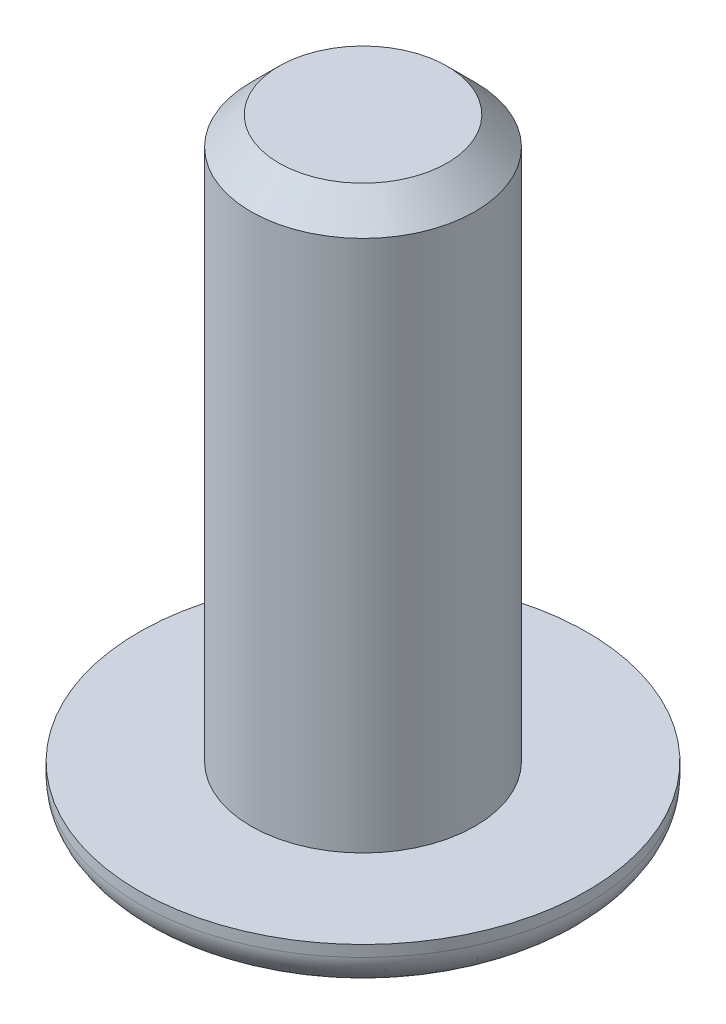
ISO-10303-21;
HEADER;
FILE_DESCRIPTION(('STEP AP214'),'2;1');
FILE_NAME('part.step','',(''),(''),'','','');
FILE_SCHEMA(('AUTOMOTIVE_DESIGN { 1 0 10303 214 1 1 1 1 }'));
ENDSEC;
DATA;
#1=APPLICATION_CONTEXT('core data for automotive mechanical design processes');
#2=APPLICATION_PROTOCOL_DEFINITION('international standard','automotive_design',2000,#1);
#3=PRODUCT_CONTEXT('',#1,'mechanical');
#4=PRODUCT('Part','Part','',(#3));
#5=PRODUCT_RELATED_PRODUCT_CATEGORY('part','',(#4));
#6=PRODUCT_DEFINITION_FORMATION('','',#4);
#7=PRODUCT_DEFINITION_CONTEXT('part definition',#1,'design');
#8=PRODUCT_DEFINITION('design','',#6,#7);
#9=PRODUCT_DEFINITION_SHAPE('','',#8);
#10=(LENGTH_UNIT() NAMED_UNIT(*) SI_UNIT(.MILLI.,.METRE.));
#11=(NAMED_UNIT(*) PLANE_ANGLE_UNIT() SI_UNIT($,.RADIAN.));
#12=(NAMED_UNIT(*) SI_UNIT($,.STERADIAN.) SOLID_ANGLE_UNIT());
#13=UNCERTAINTY_MEASURE_WITH_UNIT(LENGTH_MEASURE(1.E-05),#10,'distance_accuracy_value','');
#14=(GEOMETRIC_REPRESENTATION_CONTEXT(3) GLOBAL_UNCERTAINTY_ASSIGNED_CONTEXT((#13)) GLOBAL_UNIT_ASSIGNED_CONTEXT((#10,
#11,#12)) REPRESENTATION_CONTEXT('',''));
#15=CARTESIAN_POINT('',(0.,0.,0.));
#16=DIRECTION('',(0.,0.,1.));
#17=DIRECTION('',(1.,0.,0.));
#18=AXIS2_PLACEMENT_3D('',#15,#16,#17);
#19=CARTESIAN_POINT('',(0.,1.2,0.));
#20=DIRECTION('',(0.,1.,0.));
#21=DIRECTION('',(0.,0.,1.));
#22=AXIS2_PLACEMENT_3D('',#19,#20,#21);
#23=PLANE('',#22);
#24=CARTESIAN_POINT('',(0.,1.2,0.));
#25=DIRECTION('',(0.,1.,0.));
#26=DIRECTION('',(0.,0.,1.));
#27=AXIS2_PLACEMENT_3D('',#24,#25,#26);
#28=CIRCLE('',#27,2.);
#29=CARTESIAN_POINT('',(0.,1.2,2.));
#30=VERTEX_POINT('',#29);
#31=EDGE_CURVE('E295',#30,#30,#28,.T.);
#32=ORIENTED_EDGE('',*,*,#31,.F.);
#33=EDGE_LOOP('',(#32));
#34=FACE_BOUND('',#33,.T.);
#35=CARTESIAN_POINT('',(0.,1.2,0.));
#36=DIRECTION('',(0.,1.,0.));
#37=DIRECTION('',(0.,0.,1.));
#38=AXIS2_PLACEMENT_3D('',#35,#36,#37);
#39=CIRCLE('',#38,4.);
#40=CARTESIAN_POINT('',(0.,1.2,4.));
#41=VERTEX_POINT('',#40);
#42=EDGE_CURVE('E134',#41,#41,#39,.T.);
#43=ORIENTED_EDGE('',*,*,#42,.T.);
#44=EDGE_LOOP('',(#43));
#45=FACE_BOUND('',#44,.T.);
#46=ADVANCED_FACE('F39',(#34,#45),#23,.T.);
#47=CARTESIAN_POINT('',(0.,0.,0.));
#48=DIRECTION('',(0.,1.,0.));
#49=DIRECTION('',(0.,0.,1.));
#50=AXIS2_PLACEMENT_3D('',#47,#48,#49);
#51=PLANE('',#50);
#52=CARTESIAN_POINT('',(0.,0.,2.));
#53=CARTESIAN_POINT('',(0.261799376890833,0.,2.));
#54=CARTESIAN_POINT('',(0.523495778796538,0.,1.94794534916224));
#55=CARTESIAN_POINT('',(1.00723795066382,0.,1.74757278088291));
#56=CARTESIAN_POINT('',(1.22909344766315,0.,1.59933367708304));
#57=CARTESIAN_POINT('',(1.59933367708304,0.,1.22909344766315));
#58=CARTESIAN_POINT('',(1.74757278088293,0.,1.00723795066385));
#59=CARTESIAN_POINT('',(1.94794534916222,0.,0.52349577879651));
#60=CARTESIAN_POINT('',(2.,0.,0.261799376890842));
#61=CARTESIAN_POINT('',(2.,0.,-0.261799376890842));
#62=CARTESIAN_POINT('',(1.94794534916225,0.,-0.52349577879654));
#63=CARTESIAN_POINT('',(1.7475727808829,0.,-1.00723795066382));
#64=CARTESIAN_POINT('',(1.59933367708301,0.,-1.22909344766318));
#65=CARTESIAN_POINT('',(1.22909344766318,0.,-1.59933367708301));
#66=CARTESIAN_POINT('',(1.00723795066384,0.,-1.74757278088294));
#67=CARTESIAN_POINT('',(0.523495778796522,0.,-1.9479453491622));
#68=CARTESIAN_POINT('',(0.261799376890842,0.,-2.));
#69=CARTESIAN_POINT('',(-0.261799376890842,0.,-2.));
#70=CARTESIAN_POINT('',(-0.523495778796517,0.,-1.94794534916223));
#71=CARTESIAN_POINT('',(-1.00723795066384,0.,-1.74757278088292));
#72=CARTESIAN_POINT('',(-1.22909344766315,0.,-1.59933367708304));
#73=CARTESIAN_POINT('',(-1.59933367708304,0.,-1.22909344766315));
#74=CARTESIAN_POINT('',(-1.74757278088294,0.,-1.00723795066386));
#75=CARTESIAN_POINT('',(-1.94794534916221,0.,-0.523495778796506));
#76=CARTESIAN_POINT('',(-2.,0.,-0.261799376890839));
#77=CARTESIAN_POINT('',(-2.,0.,0.261799376890845));
#78=CARTESIAN_POINT('',(-1.94794534916221,0.,0.523495778796514));
#79=CARTESIAN_POINT('',(-1.74757278088294,0.,1.00723795066384));
#80=CARTESIAN_POINT('',(-1.59933367708301,0.,1.22909344766318));
#81=CARTESIAN_POINT('',(-1.22909344766319,0.,1.599333677083));
#82=CARTESIAN_POINT('',(-1.00723795066384,0.,1.74757278088294));
#83=CARTESIAN_POINT('',(-0.52349577879652,0.,1.94794534916221));
#84=CARTESIAN_POINT('',(-0.261799376890834,0.,2.));
#85=CARTESIAN_POINT('',(0.,0.,2.));
#86=(BOUNDED_CURVE() B_SPLINE_CURVE(3,(#52,#53,#54,#55,#56,#57,#58,#59,#60,#61,#62,#63,#64,#65,
#66,#67,#68,#69,#70,#71,#72,#73,#74,#75,#76,#77,#78,#79,#80,#81,#82,#83,#84,#85),.UNSPECIFIED.,
.T.,.F.) B_SPLINE_CURVE_WITH_KNOTS((4,2,2,2,2,2,2,2,2,2,2,2,2,2,2,2,4),(0.,0.392699081698724,
0.785398163397448,1.17809724509617,1.5707963267949,1.96349540849362,2.35619449019234,
2.74889357189107,3.14159265358979,3.53429173528852,3.92699081698724,4.31968989868597,
4.71238898038469,5.10508806208341,5.49778714378214,5.89048622548086,6.28318530717959),
.UNSPECIFIED.) CURVE() GEOMETRIC_REPRESENTATION_ITEM() RATIONAL_B_SPLINE_CURVE((1.,1.,1.,1.,1.,
1.,1.,1.,1.,1.,1.,1.,1.,1.,1.,1.,1.,1.,1.,1.,1.,1.,1.,1.,1.,1.,1.,1.,1.,1.,1.,1.,1.,1.)) REPRESENTATION_ITEM(''));
#87=CARTESIAN_POINT('',(0.,0.,2.));
#88=VERTEX_POINT('',#87);
#89=EDGE_CURVE('E12',#88,#88,#86,.F.);
#90=ORIENTED_EDGE('',*,*,#89,.T.);
#91=EDGE_LOOP('',(#90));
#92=FACE_BOUND('',#91,.T.);
#93=DIRECTION('',(0.5,0.,-0.866025403784439));
#94=VECTOR('',#93,1.);
#95=CARTESIAN_POINT('',(0.721687836487031,0.,1.25));
#96=LINE('',#95,#94);
#97=CARTESIAN_POINT('',(0.721687836487031,0.,1.25));
#98=VERTEX_POINT('',#97);
#99=CARTESIAN_POINT('',(1.44337567297406,0.,0.));
#100=VERTEX_POINT('',#99);
#101=EDGE_CURVE('E60',#98,#100,#96,.T.);
#102=ORIENTED_EDGE('',*,*,#101,.T.);
#103=DIRECTION('',(-0.5,0.,-0.866025403784439));
#104=VECTOR('',#103,1.);
#105=CARTESIAN_POINT('',(1.44337567297406,0.,0.));
#106=LINE('',#105,#104);
#107=CARTESIAN_POINT('',(0.721687836487031,0.,-1.25));
#108=VERTEX_POINT('',#107);
#109=EDGE_CURVE('E120',#100,#108,#106,.T.);
#110=ORIENTED_EDGE('',*,*,#109,.T.);
#111=DIRECTION('',(-1.,0.,0.));
#112=VECTOR('',#111,1.);
#113=CARTESIAN_POINT('',(0.721687836487031,0.,-1.25));
#114=LINE('',#113,#112);
#115=CARTESIAN_POINT('',(-0.721687836487033,0.,-1.25));
#116=VERTEX_POINT('',#115);
#117=EDGE_CURVE('E118',#108,#116,#114,.T.);
#118=ORIENTED_EDGE('',*,*,#117,.T.);
#119=DIRECTION('',(-0.5,0.,0.866025403784439));
#120=VECTOR('',#119,1.);
#121=CARTESIAN_POINT('',(-0.721687836487033,0.,-1.25));
#122=LINE('',#121,#120);
#123=CARTESIAN_POINT('',(-1.44337567297407,0.,0.));
#124=VERTEX_POINT('',#123);
#125=EDGE_CURVE('E96',#116,#124,#122,.T.);
#126=ORIENTED_EDGE('',*,*,#125,.T.);
#127=DIRECTION('',(0.5,0.,0.866025403784439));
#128=VECTOR('',#127,1.);
#129=CARTESIAN_POINT('',(-1.44337567297407,0.,0.));
#130=LINE('',#129,#128);
#131=CARTESIAN_POINT('',(-0.721687836487033,0.,1.25));
#132=VERTEX_POINT('',#131);
#133=EDGE_CURVE('E107',#124,#132,#130,.T.);
#134=ORIENTED_EDGE('',*,*,#133,.T.);
#135=DIRECTION('',(1.,0.,0.));
#136=VECTOR('',#135,1.);
#137=CARTESIAN_POINT('',(-0.721687836487033,0.,1.25));
#138=LINE('',#137,#136);
#139=EDGE_CURVE('E113',#132,#98,#138,.T.);
#140=ORIENTED_EDGE('',*,*,#139,.T.);
#141=EDGE_LOOP('',(#102,#110,#118,#126,#134,#140));
#142=FACE_BOUND('',#141,.T.);
#143=ADVANCED_FACE('F115',(#92,#142),#51,.F.);
#144=CARTESIAN_POINT('',(0.,1.2,0.));
#145=DIRECTION('',(0.,-1.,0.));
#146=DIRECTION('',(0.,0.,-1.));
#147=AXIS2_PLACEMENT_3D('',#144,#145,#146);
#148=CYLINDRICAL_SURFACE('',#147,4.);
#149=CARTESIAN_POINT('',(0.,1.,4.));
#150=CARTESIAN_POINT('',(-0.523598753781667,1.,4.));
#151=CARTESIAN_POINT('',(-1.04699155759304,1.,3.89589069832441));
#152=CARTESIAN_POINT('',(-2.01447590132769,1.,3.49514556176588));
#153=CARTESIAN_POINT('',(-2.45818689532638,1.,3.198667354166));
#154=CARTESIAN_POINT('',(-3.19866735416602,1.,2.45818689532636));
#155=CARTESIAN_POINT('',(-3.49514556176589,1.,2.01447590132768));
#156=CARTESIAN_POINT('',(-3.89589069832441,1.,1.04699155759303));
#157=CARTESIAN_POINT('',(-4.,1.,0.523598753781691));
#158=CARTESIAN_POINT('',(-4.,1.,-0.523598753781678));
#159=CARTESIAN_POINT('',(-3.89589069832442,1.,-1.04699155759301));
#160=CARTESIAN_POINT('',(-3.49514556176587,1.,-2.01447590132771));
#161=CARTESIAN_POINT('',(-3.19866735416608,1.,-2.4581868953263));
#162=CARTESIAN_POINT('',(-2.4581868953263,1.,-3.19866735416608));
#163=CARTESIAN_POINT('',(-2.01447590132769,1.,-3.49514556176588));
#164=CARTESIAN_POINT('',(-1.04699155759301,1.,-3.89589069832442));
#165=CARTESIAN_POINT('',(-0.523598753781683,1.,-4.));
#166=CARTESIAN_POINT('',(0.523598753781684,1.,-4.));
#167=CARTESIAN_POINT('',(1.04699155759304,1.,-3.89589069832441));
#168=CARTESIAN_POINT('',(2.01447590132768,1.,-3.49514556176588));
#169=CARTESIAN_POINT('',(2.45818689532636,1.,-3.19866735416603));
#170=CARTESIAN_POINT('',(3.19866735416602,1.,-2.45818689532636));
#171=CARTESIAN_POINT('',(3.49514556176589,1.,-2.01447590132768));
#172=CARTESIAN_POINT('',(3.89589069832441,1.,-1.04699155759304));
#173=CARTESIAN_POINT('',(4.,1.,-0.523598753781683));
#174=CARTESIAN_POINT('',(4.,1.,0.523598753781684));
#175=CARTESIAN_POINT('',(3.89589069832442,1.,1.04699155759301));
#176=CARTESIAN_POINT('',(3.49514556176588,1.,2.0144759013277));
#177=CARTESIAN_POINT('',(3.19866735416607,1.,2.45818689532631));
#178=CARTESIAN_POINT('',(2.45818689532631,1.,3.19866735416607));
#179=CARTESIAN_POINT('',(2.01447590132769,1.,3.49514556176588));
#180=CARTESIAN_POINT('',(1.04699155759303,1.,3.89589069832441));
#181=CARTESIAN_POINT('',(0.523598753781667,1.,4.));
#182=CARTESIAN_POINT('',(0.,1.,4.));
#183=(BOUNDED_CURVE() B_SPLINE_CURVE(3,(#149,#150,#151,#152,#153,#154,#155,#156,#157,#158,#159,
#160,#161,#162,#163,#164,#165,#166,#167,#168,#169,#170,#171,#172,#173,#174,#175,#176,#177,#178,
#179,#180,#181,#182),.UNSPECIFIED.,.T.,.F.) B_SPLINE_CURVE_WITH_KNOTS((4,2,2,2,2,2,2,2,2,2,2,2,
2,2,2,2,4),(0.,0.392699081698725,0.785398163397448,1.17809724509617,1.5707963267949,
1.96349540849362,2.35619449019234,2.74889357189107,3.14159265358979,3.53429173528852,
3.92699081698724,4.31968989868597,4.71238898038469,5.10508806208341,5.49778714378214,
5.89048622548086,6.28318530717959),
.UNSPECIFIED.) CURVE() GEOMETRIC_REPRESENTATION_ITEM() RATIONAL_B_SPLINE_CURVE((1.,1.,1.,1.,1.,
1.,1.,1.,1.,1.,1.,1.,1.,1.,1.,1.,1.,1.,1.,1.,1.,1.,1.,1.,1.,1.,1.,1.,1.,1.,1.,1.,1.,1.)) REPRESENTATION_ITEM(''));
#184=CARTESIAN_POINT('',(0.,1.,4.));
#185=VERTEX_POINT('',#184);
#186=EDGE_CURVE('E53',#185,#185,#183,.F.);
#187=ORIENTED_EDGE('',*,*,#186,.T.);
#188=EDGE_LOOP('',(#187));
#189=FACE_BOUND('',#188,.T.);
#190=ORIENTED_EDGE('',*,*,#42,.F.);
#191=EDGE_LOOP('',(#190));
#192=FACE_BOUND('',#191,.T.);
#193=ADVANCED_FACE('F152',(#189,#192),#148,.T.);
#194=CARTESIAN_POINT('',(0.721687836487031,1.2,1.25));
#195=DIRECTION('',(-0.866025403784439,0.,-0.5));
#196=DIRECTION('',(-0.5,0.,0.866025403784439));
#197=AXIS2_PLACEMENT_3D('',#194,#195,#196);
#198=PLANE('',#197);
#199=ORIENTED_EDGE('',*,*,#101,.F.);
#200=DIRECTION('',(0.,-1.,0.));
#201=VECTOR('',#200,1.);
#202=CARTESIAN_POINT('',(0.721687836487031,1.2,1.25));
#203=LINE('',#202,#201);
#204=CARTESIAN_POINT('',(0.721687836487031,1.2,1.25));
#205=VERTEX_POINT('',#204);
#206=EDGE_CURVE('E125',#205,#98,#203,.T.);
#207=ORIENTED_EDGE('',*,*,#206,.F.);
#208=DIRECTION('',(0.5,0.,-0.866025403784439));
#209=VECTOR('',#208,1.);
#210=CARTESIAN_POINT('',(0.721687836487031,1.2,1.25));
#211=LINE('',#210,#209);
#212=CARTESIAN_POINT('',(1.44337567297406,1.2,0.));
#213=VERTEX_POINT('',#212);
#214=EDGE_CURVE('E69',#205,#213,#211,.T.);
#215=ORIENTED_EDGE('',*,*,#214,.T.);
#216=DIRECTION('',(0.,-1.,0.));
#217=VECTOR('',#216,1.);
#218=CARTESIAN_POINT('',(1.44337567297406,1.2,0.));
#219=LINE('',#218,#217);
#220=EDGE_CURVE('E132',#213,#100,#219,.T.);
#221=ORIENTED_EDGE('',*,*,#220,.T.);
#222=EDGE_LOOP('',(#199,#207,#215,#221));
#223=FACE_BOUND('',#222,.T.);
#224=ADVANCED_FACE('F161',(#223),#198,.T.);
#225=CARTESIAN_POINT('',(1.44337567297406,1.2,0.));
#226=DIRECTION('',(-0.866025403784439,0.,0.5));
#227=DIRECTION('',(0.5,0.,0.866025403784439));
#228=AXIS2_PLACEMENT_3D('',#225,#226,#227);
#229=PLANE('',#228);
#230=ORIENTED_EDGE('',*,*,#109,.F.);
#231=ORIENTED_EDGE('',*,*,#220,.F.);
#232=DIRECTION('',(-0.5,0.,-0.866025403784439));
#233=VECTOR('',#232,1.);
#234=CARTESIAN_POINT('',(1.44337567297406,1.2,0.));
#235=LINE('',#234,#233);
#236=CARTESIAN_POINT('',(0.721687836487031,1.2,-1.25));
#237=VERTEX_POINT('',#236);
#238=EDGE_CURVE('E300',#213,#237,#235,.T.);
#239=ORIENTED_EDGE('',*,*,#238,.T.);
#240=DIRECTION('',(0.,-1.,0.));
#241=VECTOR('',#240,1.);
#242=CARTESIAN_POINT('',(0.721687836487031,1.2,-1.25));
#243=LINE('',#242,#241);
#244=EDGE_CURVE('E130',#237,#108,#243,.T.);
#245=ORIENTED_EDGE('',*,*,#244,.T.);
#246=EDGE_LOOP('',(#230,#231,#239,#245));
#247=FACE_BOUND('',#246,.T.);
#248=ADVANCED_FACE('F192',(#247),#229,.T.);
#249=CARTESIAN_POINT('',(0.721687836487031,1.2,-1.25));
#250=DIRECTION('',(0.,0.,1.));
#251=DIRECTION('',(1.,0.,0.));
#252=AXIS2_PLACEMENT_3D('',#249,#250,#251);
#253=PLANE('',#252);
#254=ORIENTED_EDGE('',*,*,#117,.F.);
#255=ORIENTED_EDGE('',*,*,#244,.F.);
#256=DIRECTION('',(-1.,0.,0.));
#257=VECTOR('',#256,1.);
#258=CARTESIAN_POINT('',(0.721687836487031,1.2,-1.25));
#259=LINE('',#258,#257);
#260=CARTESIAN_POINT('',(-0.721687836487033,1.2,-1.25));
#261=VERTEX_POINT('',#260);
#262=EDGE_CURVE('E303',#237,#261,#259,.T.);
#263=ORIENTED_EDGE('',*,*,#262,.T.);
#264=DIRECTION('',(0.,-1.,0.));
#265=VECTOR('',#264,1.);
#266=CARTESIAN_POINT('',(-0.721687836487033,1.2,-1.25));
#267=LINE('',#266,#265);
#268=EDGE_CURVE('E103',#261,#116,#267,.T.);
#269=ORIENTED_EDGE('',*,*,#268,.T.);
#270=EDGE_LOOP('',(#254,#255,#263,#269));
#271=FACE_BOUND('',#270,.T.);
#272=ADVANCED_FACE('F195',(#271),#253,.T.);
#273=CARTESIAN_POINT('',(-0.721687836487033,1.2,-1.25));
#274=DIRECTION('',(0.866025403784439,0.,0.5));
#275=DIRECTION('',(0.5,0.,-0.866025403784439));
#276=AXIS2_PLACEMENT_3D('',#273,#274,#275);
#277=PLANE('',#276);
#278=ORIENTED_EDGE('',*,*,#125,.F.);
#279=ORIENTED_EDGE('',*,*,#268,.F.);
#280=DIRECTION('',(-0.5,0.,0.866025403784439));
#281=VECTOR('',#280,1.);
#282=CARTESIAN_POINT('',(-0.721687836487033,1.2,-1.25));
#283=LINE('',#282,#281);
#284=CARTESIAN_POINT('',(-1.44337567297407,1.2,0.));
#285=VERTEX_POINT('',#284);
#286=EDGE_CURVE('E100',#261,#285,#283,.T.);
#287=ORIENTED_EDGE('',*,*,#286,.T.);
#288=DIRECTION('',(0.,-1.,0.));
#289=VECTOR('',#288,1.);
#290=CARTESIAN_POINT('',(-1.44337567297407,1.2,0.));
#291=LINE('',#290,#289);
#292=EDGE_CURVE('E91',#285,#124,#291,.T.);
#293=ORIENTED_EDGE('',*,*,#292,.T.);
#294=EDGE_LOOP('',(#278,#279,#287,#293));
#295=FACE_BOUND('',#294,.T.);
#296=ADVANCED_FACE('F93',(#295),#277,.T.);
#297=CARTESIAN_POINT('',(-1.44337567297407,1.2,0.));
#298=DIRECTION('',(0.866025403784439,0.,-0.5));
#299=DIRECTION('',(-0.5,0.,-0.866025403784439));
#300=AXIS2_PLACEMENT_3D('',#297,#298,#299);
#301=PLANE('',#300);
#302=ORIENTED_EDGE('',*,*,#133,.F.);
#303=ORIENTED_EDGE('',*,*,#292,.F.);
#304=DIRECTION('',(0.5,0.,0.866025403784439));
#305=VECTOR('',#304,1.);
#306=CARTESIAN_POINT('',(-1.44337567297407,1.2,0.));
#307=LINE('',#306,#305);
#308=CARTESIAN_POINT('',(-0.721687836487033,1.2,1.25));
#309=VERTEX_POINT('',#308);
#310=EDGE_CURVE('E307',#285,#309,#307,.T.);
#311=ORIENTED_EDGE('',*,*,#310,.T.);
#312=DIRECTION('',(0.,-1.,0.));
#313=VECTOR('',#312,1.);
#314=CARTESIAN_POINT('',(-0.721687836487033,1.2,1.25));
#315=LINE('',#314,#313);
#316=EDGE_CURVE('E104',#309,#132,#315,.T.);
#317=ORIENTED_EDGE('',*,*,#316,.T.);
#318=EDGE_LOOP('',(#302,#303,#311,#317));
#319=FACE_BOUND('',#318,.T.);
#320=ADVANCED_FACE('F108',(#319),#301,.T.);
#321=CARTESIAN_POINT('',(-0.721687836487033,1.2,1.25));
#322=DIRECTION('',(0.,0.,-1.));
#323=DIRECTION('',(-1.,0.,0.));
#324=AXIS2_PLACEMENT_3D('',#321,#322,#323);
#325=PLANE('',#324);
#326=ORIENTED_EDGE('',*,*,#139,.F.);
#327=ORIENTED_EDGE('',*,*,#316,.F.);
#328=DIRECTION('',(1.,0.,0.));
#329=VECTOR('',#328,1.);
#330=CARTESIAN_POINT('',(-0.721687836487033,1.2,1.25));
#331=LINE('',#330,#329);
#332=EDGE_CURVE('E127',#309,#205,#331,.T.);
#333=ORIENTED_EDGE('',*,*,#332,.T.);
#334=ORIENTED_EDGE('',*,*,#206,.T.);
#335=EDGE_LOOP('',(#326,#327,#333,#334));
#336=FACE_BOUND('',#335,.T.);
#337=ADVANCED_FACE('F204',(#336),#325,.T.);
#338=CARTESIAN_POINT('',(0.,1.2,0.));
#339=DIRECTION('',(0.,1.,0.));
#340=DIRECTION('',(0.,0.,1.));
#341=AXIS2_PLACEMENT_3D('',#338,#339,#340);
#342=PLANE('',#341);
#343=ORIENTED_EDGE('',*,*,#214,.F.);
#344=ORIENTED_EDGE('',*,*,#332,.F.);
#345=ORIENTED_EDGE('',*,*,#310,.F.);
#346=ORIENTED_EDGE('',*,*,#286,.F.);
#347=ORIENTED_EDGE('',*,*,#262,.F.);
#348=ORIENTED_EDGE('',*,*,#238,.F.);
#349=EDGE_LOOP('',(#343,#344,#345,#346,#347,#348));
#350=FACE_BOUND('',#349,.T.);
#351=ADVANCED_FACE('F207',(#350),#342,.F.);
#352=CARTESIAN_POINT('',(0.,11.2,0.));
#353=DIRECTION('',(0.,-1.,0.));
#354=DIRECTION('',(0.,0.,-1.));
#355=AXIS2_PLACEMENT_3D('',#352,#353,#354);
#356=CYLINDRICAL_SURFACE('',#355,2.);
#357=CARTESIAN_POINT('',(0.,10.7,0.));
#358=DIRECTION('',(0.,1.,0.));
#359=DIRECTION('',(0.,0.,1.));
#360=AXIS2_PLACEMENT_3D('',#357,#358,#359);
#361=CIRCLE('',#360,2.);
#362=CARTESIAN_POINT('',(0.,10.7,2.));
#363=VERTEX_POINT('',#362);
#364=EDGE_CURVE('E140',#363,#363,#361,.F.);
#365=ORIENTED_EDGE('',*,*,#364,.T.);
#366=EDGE_LOOP('',(#365));
#367=FACE_BOUND('',#366,.T.);
#368=ORIENTED_EDGE('',*,*,#31,.T.);
#369=EDGE_LOOP('',(#368));
#370=FACE_BOUND('',#369,.T.);
#371=ADVANCED_FACE('F176',(#367,#370),#356,.T.);
#372=CARTESIAN_POINT('',(0.,11.2,0.));
#373=DIRECTION('',(0.,1.,0.));
#374=DIRECTION('',(0.,0.,1.));
#375=AXIS2_PLACEMENT_3D('',#372,#373,#374);
#376=PLANE('',#375);
#377=CARTESIAN_POINT('',(0.,11.2,0.));
#378=DIRECTION('',(0.,1.,0.));
#379=DIRECTION('',(0.,0.,1.));
#380=AXIS2_PLACEMENT_3D('',#377,#378,#379);
#381=CIRCLE('',#380,1.5);
#382=CARTESIAN_POINT('',(0.,11.2,1.5));
#383=VERTEX_POINT('',#382);
#384=EDGE_CURVE('E137',#383,#383,#381,.T.);
#385=ORIENTED_EDGE('',*,*,#384,.T.);
#386=EDGE_LOOP('',(#385));
#387=FACE_BOUND('',#386,.T.);
#388=ADVANCED_FACE('F169',(#387),#376,.T.);
#389=CARTESIAN_POINT('',(0.,11.2,0.));
#390=DIRECTION('',(0.,-1.,0.));
#391=DIRECTION('',(0.,0.,-1.));
#392=AXIS2_PLACEMENT_3D('',#389,#390,#391);
#393=CONICAL_SURFACE('',#392,1.5,0.785398163397445);
#394=ORIENTED_EDGE('',*,*,#364,.F.);
#395=EDGE_LOOP('',(#394));
#396=FACE_BOUND('',#395,.T.);
#397=ORIENTED_EDGE('',*,*,#384,.F.);
#398=EDGE_LOOP('',(#397));
#399=FACE_BOUND('',#398,.T.);
#400=ADVANCED_FACE('F165',(#396,#399),#393,.T.);
#401=CARTESIAN_POINT('',(0.,1.,4.));
#402=CARTESIAN_POINT('',(0.523598753781667,1.,4.));
#403=CARTESIAN_POINT('',(1.04699155759303,1.,3.89589069832441));
#404=CARTESIAN_POINT('',(2.01447590132769,1.,3.49514556176588));
#405=CARTESIAN_POINT('',(2.45818689532631,1.,3.19866735416607));
#406=CARTESIAN_POINT('',(3.19866735416607,1.,2.45818689532631));
#407=CARTESIAN_POINT('',(3.49514556176588,1.,2.0144759013277));
#408=CARTESIAN_POINT('',(3.89589069832442,1.,1.04699155759301));
#409=CARTESIAN_POINT('',(4.,1.,0.523598753781684));
#410=CARTESIAN_POINT('',(4.,1.,-0.523598753781683));
#411=CARTESIAN_POINT('',(3.89589069832441,1.,-1.04699155759304));
#412=CARTESIAN_POINT('',(3.49514556176589,1.,-2.01447590132768));
#413=CARTESIAN_POINT('',(3.19866735416602,1.,-2.45818689532636));
#414=CARTESIAN_POINT('',(2.45818689532636,1.,-3.19866735416603));
#415=CARTESIAN_POINT('',(2.01447590132768,1.,-3.49514556176588));
#416=CARTESIAN_POINT('',(1.04699155759304,1.,-3.89589069832441));
#417=CARTESIAN_POINT('',(0.523598753781684,1.,-4.));
#418=CARTESIAN_POINT('',(-0.523598753781683,1.,-4.));
#419=CARTESIAN_POINT('',(-1.04699155759301,1.,-3.89589069832442));
#420=CARTESIAN_POINT('',(-2.01447590132769,1.,-3.49514556176588));
#421=CARTESIAN_POINT('',(-2.4581868953263,1.,-3.19866735416608));
#422=CARTESIAN_POINT('',(-3.19866735416608,1.,-2.4581868953263));
#423=CARTESIAN_POINT('',(-3.49514556176587,1.,-2.01447590132771));
#424=CARTESIAN_POINT('',(-3.89589069832442,1.,-1.04699155759301));
#425=CARTESIAN_POINT('',(-4.,1.,-0.523598753781678));
#426=CARTESIAN_POINT('',(-4.,1.,0.523598753781691));
#427=CARTESIAN_POINT('',(-3.89589069832441,1.,1.04699155759303));
#428=CARTESIAN_POINT('',(-3.49514556176589,1.,2.01447590132768));
#429=CARTESIAN_POINT('',(-3.19866735416602,1.,2.45818689532636));
#430=CARTESIAN_POINT('',(-2.45818689532638,1.,3.198667354166));
#431=CARTESIAN_POINT('',(-2.01447590132769,1.,3.49514556176588));
#432=CARTESIAN_POINT('',(-1.04699155759304,1.,3.89589069832441));
#433=CARTESIAN_POINT('',(-0.523598753781667,1.,4.));
#434=CARTESIAN_POINT('',(0.,1.,4.));
#435=CARTESIAN_POINT('',(0.,0.,4.));
#436=CARTESIAN_POINT('',(0.523598753781667,0.,4.));
#437=CARTESIAN_POINT('',(1.04699155759308,0.,3.89589069832453));
#438=CARTESIAN_POINT('',(2.01447590132764,0.,3.49514556176576));
#439=CARTESIAN_POINT('',(2.45818689532636,0.,3.19866735416602));
#440=CARTESIAN_POINT('',(3.19866735416602,0.,2.45818689532636));
#441=CARTESIAN_POINT('',(3.49514556176586,0.,2.01447590132772));
#442=CARTESIAN_POINT('',(3.89589069832444,0.,1.04699155759299));
#443=CARTESIAN_POINT('',(4.,0.,0.523598753781684));
#444=CARTESIAN_POINT('',(4.,0.,-0.523598753781683));
#445=CARTESIAN_POINT('',(3.89589069832444,0.,-1.04699155759302));
#446=CARTESIAN_POINT('',(3.49514556176585,0.,-2.0144759013277));
#447=CARTESIAN_POINT('',(3.19866735416602,0.,-2.4581868953263));
#448=CARTESIAN_POINT('',(2.45818689532636,0.,-3.19866735416608));
#449=CARTESIAN_POINT('',(2.01447590132768,0.,-3.49514556176594));
#450=CARTESIAN_POINT('',(1.04699155759304,0.,-3.89589069832435));
#451=CARTESIAN_POINT('',(0.523598753781684,0.,-4.));
#452=CARTESIAN_POINT('',(-0.523598753781683,0.,-4.));
#453=CARTESIAN_POINT('',(-1.04699155759303,0.,-3.89589069832447));
#454=CARTESIAN_POINT('',(-2.01447590132767,0.,-3.49514556176583));
#455=CARTESIAN_POINT('',(-2.4581868953263,0.,-3.19866735416614));
#456=CARTESIAN_POINT('',(-3.19866735416608,0.,-2.45818689532624));
#457=CARTESIAN_POINT('',(-3.49514556176576,0.,-2.01447590132774));
#458=CARTESIAN_POINT('',(-3.89589069832453,0.,-1.04699155759298));
#459=CARTESIAN_POINT('',(-4.,0.,-0.523598753781678));
#460=CARTESIAN_POINT('',(-4.,0.,0.523598753781691));
#461=CARTESIAN_POINT('',(-3.89589069832447,0.,1.04699155759303));
#462=CARTESIAN_POINT('',(-3.49514556176582,0.,2.01447590132768));
#463=CARTESIAN_POINT('',(-3.19866735416596,0.,2.45818689532636));
#464=CARTESIAN_POINT('',(-2.45818689532643,0.,3.198667354166));
#465=CARTESIAN_POINT('',(-2.01447590132766,0.,3.49514556176576));
#466=CARTESIAN_POINT('',(-1.04699155759307,0.,3.89589069832453));
#467=CARTESIAN_POINT('',(-0.523598753781667,0.,4.));
#468=CARTESIAN_POINT('',(0.,0.,4.));
#469=CARTESIAN_POINT('',(0.,0.,2.));
#470=CARTESIAN_POINT('',(0.261799376890833,0.,2.));
#471=CARTESIAN_POINT('',(0.523495778796538,0.,1.94794534916224));
#472=CARTESIAN_POINT('',(1.00723795066382,0.,1.74757278088291));
#473=CARTESIAN_POINT('',(1.22909344766315,0.,1.59933367708304));
#474=CARTESIAN_POINT('',(1.59933367708304,0.,1.22909344766315));
#475=CARTESIAN_POINT('',(1.74757278088293,0.,1.00723795066385));
#476=CARTESIAN_POINT('',(1.94794534916222,0.,0.52349577879651));
#477=CARTESIAN_POINT('',(2.,0.,0.261799376890842));
#478=CARTESIAN_POINT('',(2.,0.,-0.261799376890842));
#479=CARTESIAN_POINT('',(1.94794534916225,0.,-0.52349577879654));
#480=CARTESIAN_POINT('',(1.7475727808829,0.,-1.00723795066382));
#481=CARTESIAN_POINT('',(1.59933367708301,0.,-1.22909344766318));
#482=CARTESIAN_POINT('',(1.22909344766318,0.,-1.59933367708301));
#483=CARTESIAN_POINT('',(1.00723795066384,0.,-1.74757278088294));
#484=CARTESIAN_POINT('',(0.523495778796522,0.,-1.9479453491622));
#485=CARTESIAN_POINT('',(0.261799376890842,0.,-2.));
#486=CARTESIAN_POINT('',(-0.261799376890842,0.,-2.));
#487=CARTESIAN_POINT('',(-0.523495778796517,0.,-1.94794534916223));
#488=CARTESIAN_POINT('',(-1.00723795066384,0.,-1.74757278088292));
#489=CARTESIAN_POINT('',(-1.22909344766315,0.,-1.59933367708304));
#490=CARTESIAN_POINT('',(-1.59933367708304,0.,-1.22909344766315));
#491=CARTESIAN_POINT('',(-1.74757278088294,0.,-1.00723795066386));
#492=CARTESIAN_POINT('',(-1.94794534916221,0.,-0.523495778796506));
#493=CARTESIAN_POINT('',(-2.,0.,-0.261799376890839));
#494=CARTESIAN_POINT('',(-2.,0.,0.261799376890845));
#495=CARTESIAN_POINT('',(-1.94794534916221,0.,0.523495778796514));
#496=CARTESIAN_POINT('',(-1.74757278088294,0.,1.00723795066384));
#497=CARTESIAN_POINT('',(-1.59933367708301,0.,1.22909344766318));
#498=CARTESIAN_POINT('',(-1.22909344766319,0.,1.599333677083));
#499=CARTESIAN_POINT('',(-1.00723795066384,0.,1.74757278088294));
#500=CARTESIAN_POINT('',(-0.52349577879652,0.,1.94794534916221));
#501=CARTESIAN_POINT('',(-0.261799376890834,0.,2.));
#502=CARTESIAN_POINT('',(0.,0.,2.));
#503=(BOUNDED_SURFACE() B_SPLINE_SURFACE(2,3,((#401,#402,#403,#404,#405,#406,#407,#408,#409,
#410,#411,#412,#413,#414,#415,#416,#417,#418,#419,#420,#421,#422,#423,#424,#425,#426,#427,#428,
#429,#430,#431,#432,#433,#434),(#435,#436,#437,#438,#439,#440,#441,#442,#443,#444,#445,#446,
#447,#448,#449,#450,#451,#452,#453,#454,#455,#456,#457,#458,#459,#460,#461,#462,#463,#464,#465,
#466,#467,#468),(#469,#470,#471,#472,#473,#474,#475,#476,#477,#478,#479,#480,#481,#482,#483,
#484,#485,#486,#487,#488,#489,#490,#491,#492,#493,#494,#495,#496,#497,#498,#499,#500,#501,
#502)),.UNSPECIFIED.,.F.,.T.,.F.) B_SPLINE_SURFACE_WITH_KNOTS((3,3),(4,2,2,2,2,2,2,2,2,2,2,2,2,
2,2,2,4),(0.,1.),(0.,0.392699081698724,0.785398163397448,1.17809724509617,1.5707963267949,
1.96349540849362,2.35619449019234,2.74889357189107,3.14159265358979,3.53429173528852,
3.92699081698724,4.31968989868597,4.71238898038469,5.10508806208341,5.49778714378214,
5.89048622548086,6.28318530717959),
.UNSPECIFIED.) GEOMETRIC_REPRESENTATION_ITEM() RATIONAL_B_SPLINE_SURFACE(((1.,1.,1.,1.,1.,1.,1.,
1.,1.,1.,1.,1.,1.,1.,1.,1.,1.,1.,1.,1.,1.,1.,1.,1.,1.,1.,1.,1.,1.,1.,1.,1.,1.,1.),
(0.707106781186548,0.707106781186548,0.707106781186548,0.707106781186548,0.707106781186548,
0.707106781186548,0.707106781186548,0.707106781186548,0.707106781186548,0.707106781186548,
0.707106781186548,0.707106781186548,0.707106781186548,0.707106781186548,0.707106781186548,
0.707106781186548,0.707106781186548,0.707106781186548,0.707106781186548,0.707106781186548,
0.707106781186548,0.707106781186548,0.707106781186548,0.707106781186548,0.707106781186548,
0.707106781186548,0.707106781186548,0.707106781186548,0.707106781186547,0.707106781186547,
0.707106781186548,0.707106781186548,0.707106781186548,0.707106781186548),(1.,1.,1.,1.,1.,1.,1.,
1.,1.,1.,1.,1.,1.,1.,1.,1.,1.,1.,1.,1.,1.,1.,1.,1.,1.,1.,1.,1.,1.,1.,1.,1.,1.,1.))) REPRESENTATION_ITEM('') SURFACE());
#504=ORIENTED_EDGE('',*,*,#89,.F.);
#505=EDGE_LOOP('',(#504));
#506=FACE_BOUND('',#505,.T.);
#507=ORIENTED_EDGE('',*,*,#186,.F.);
#508=EDGE_LOOP('',(#507));
#509=FACE_BOUND('',#508,.T.);
#510=ADVANCED_FACE('F42',(#506,#509),#503,.T.);
#511=CLOSED_SHELL('',(#46,#143,#193,#224,#248,#272,#296,#320,#337,#351,#371,#388,#400,#510));
#512=MANIFOLD_SOLID_BREP('B2',#511);
#513=ADVANCED_BREP_SHAPE_REPRESENTATION('',(#18,#512),#14);
#514=SHAPE_DEFINITION_REPRESENTATION(#9,#513);
ENDSEC;
END-ISO-10303-21;
